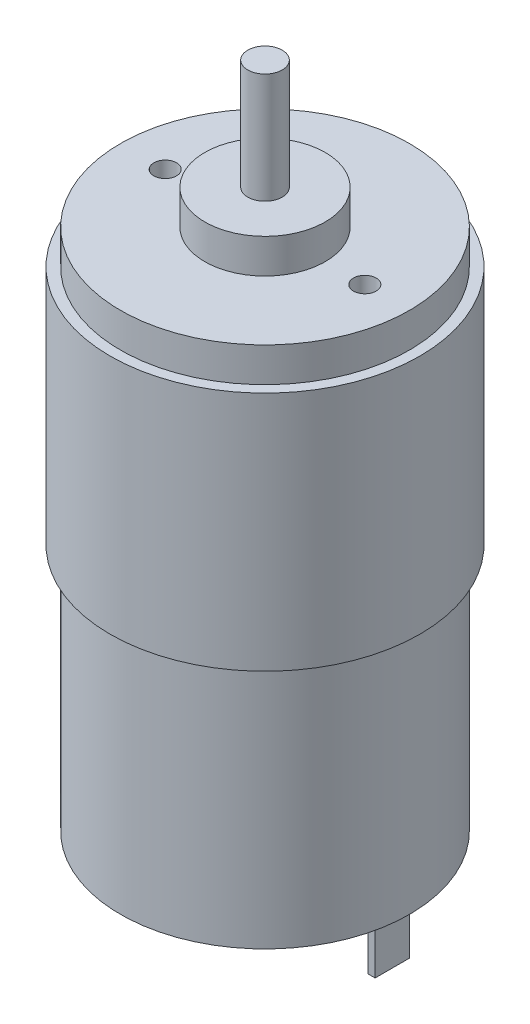
ISO-10303-21;
HEADER;
FILE_DESCRIPTION(('STEP AP214'),'2;1');
FILE_NAME('part.step','',(''),(''),'','','');
FILE_SCHEMA(('AUTOMOTIVE_DESIGN { 1 0 10303 214 1 1 1 1 }'));
ENDSEC;
DATA;
#1=APPLICATION_CONTEXT('core data for automotive mechanical design processes');
#2=APPLICATION_PROTOCOL_DEFINITION('international standard','automotive_design',2000,#1);
#3=PRODUCT_CONTEXT('',#1,'mechanical');
#4=PRODUCT('Part','Part','',(#3));
#5=PRODUCT_RELATED_PRODUCT_CATEGORY('part','',(#4));
#6=PRODUCT_DEFINITION_FORMATION('','',#4);
#7=PRODUCT_DEFINITION_CONTEXT('part definition',#1,'design');
#8=PRODUCT_DEFINITION('design','',#6,#7);
#9=PRODUCT_DEFINITION_SHAPE('','',#8);
#10=(LENGTH_UNIT() NAMED_UNIT(*) SI_UNIT(.MILLI.,.METRE.));
#11=(NAMED_UNIT(*) PLANE_ANGLE_UNIT() SI_UNIT($,.RADIAN.));
#12=(NAMED_UNIT(*) SI_UNIT($,.STERADIAN.) SOLID_ANGLE_UNIT());
#13=UNCERTAINTY_MEASURE_WITH_UNIT(LENGTH_MEASURE(1.E-05),#10,'distance_accuracy_value','');
#14=(GEOMETRIC_REPRESENTATION_CONTEXT(3) GLOBAL_UNCERTAINTY_ASSIGNED_CONTEXT((#13)) GLOBAL_UNIT_ASSIGNED_CONTEXT((#10,
#11,#12)) REPRESENTATION_CONTEXT('',''));
#15=CARTESIAN_POINT('',(0.,0.,0.));
#16=DIRECTION('',(0.,0.,1.));
#17=DIRECTION('',(1.,0.,0.));
#18=AXIS2_PLACEMENT_3D('',#15,#16,#17);
#19=CARTESIAN_POINT('',(21.,7.99999999999999,0.));
#20=DIRECTION('',(0.,-1.,0.));
#21=DIRECTION('',(0.,0.,-1.));
#22=AXIS2_PLACEMENT_3D('',#19,#20,#21);
#23=PLANE('',#22);
#24=CARTESIAN_POINT('',(0.,7.99999999999999,0.));
#25=DIRECTION('',(0.,-1.,0.));
#26=DIRECTION('',(0.,0.,-1.));
#27=AXIS2_PLACEMENT_3D('',#24,#25,#26);
#28=CIRCLE('',#27,21.);
#29=CARTESIAN_POINT('',(0.,7.99999999999999,-21.));
#30=VERTEX_POINT('',#29);
#31=EDGE_CURVE('E226',#30,#30,#28,.T.);
#32=ORIENTED_EDGE('',*,*,#31,.T.);
#33=EDGE_LOOP('',(#32));
#34=FACE_BOUND('',#33,.T.);
#35=CARTESIAN_POINT('',(0.,7.99999999999999,0.));
#36=DIRECTION('',(0.,-1.,0.));
#37=DIRECTION('',(0.,0.,-1.));
#38=AXIS2_PLACEMENT_3D('',#35,#36,#37);
#39=CIRCLE('',#38,8.75000000000001);
#40=CARTESIAN_POINT('',(0.,7.99999999999999,-8.75000000000001));
#41=VERTEX_POINT('',#40);
#42=EDGE_CURVE('E222',#41,#41,#39,.T.);
#43=ORIENTED_EDGE('',*,*,#42,.F.);
#44=EDGE_LOOP('',(#43));
#45=FACE_BOUND('',#44,.T.);
#46=DIRECTION('',(-1.,0.,0.));
#47=VECTOR('',#46,1.);
#48=CARTESIAN_POINT('',(18.5,7.99999999999999,2.5));
#49=LINE('',#48,#47);
#50=CARTESIAN_POINT('',(18.5,7.99999999999999,2.5));
#51=VERTEX_POINT('',#50);
#52=CARTESIAN_POINT('',(17.5,7.99999999999999,2.5));
#53=VERTEX_POINT('',#52);
#54=EDGE_CURVE('E168',#51,#53,#49,.T.);
#55=ORIENTED_EDGE('',*,*,#54,.F.);
#56=DIRECTION('',(0.,0.,1.));
#57=VECTOR('',#56,1.);
#58=CARTESIAN_POINT('',(18.5,7.99999999999999,-2.5));
#59=LINE('',#58,#57);
#60=CARTESIAN_POINT('',(18.5,7.99999999999999,-2.5));
#61=VERTEX_POINT('',#60);
#62=EDGE_CURVE('E160',#61,#51,#59,.T.);
#63=ORIENTED_EDGE('',*,*,#62,.F.);
#64=DIRECTION('',(1.,0.,0.));
#65=VECTOR('',#64,1.);
#66=CARTESIAN_POINT('',(18.5,7.99999999999999,-2.5));
#67=LINE('',#66,#65);
#68=CARTESIAN_POINT('',(17.5,7.99999999999999,-2.5));
#69=VERTEX_POINT('',#68);
#70=EDGE_CURVE('E164',#69,#61,#67,.T.);
#71=ORIENTED_EDGE('',*,*,#70,.F.);
#72=DIRECTION('',(0.,0.,-1.));
#73=VECTOR('',#72,1.);
#74=CARTESIAN_POINT('',(17.5,7.99999999999999,-2.5));
#75=LINE('',#74,#73);
#76=EDGE_CURVE('E69',#53,#69,#75,.T.);
#77=ORIENTED_EDGE('',*,*,#76,.F.);
#78=EDGE_LOOP('',(#55,#63,#71,#77));
#79=FACE_BOUND('',#78,.T.);
#80=DIRECTION('',(-1.,0.,0.));
#81=VECTOR('',#80,1.);
#82=CARTESIAN_POINT('',(-18.5,7.99999999999999,2.5));
#83=LINE('',#82,#81);
#84=CARTESIAN_POINT('',(-17.5,7.99999999999999,2.5));
#85=VERTEX_POINT('',#84);
#86=CARTESIAN_POINT('',(-18.5,7.99999999999999,2.5));
#87=VERTEX_POINT('',#86);
#88=EDGE_CURVE('E151',#85,#87,#83,.T.);
#89=ORIENTED_EDGE('',*,*,#88,.F.);
#90=DIRECTION('',(0.,0.,1.));
#91=VECTOR('',#90,1.);
#92=CARTESIAN_POINT('',(-17.5,7.99999999999999,-2.5));
#93=LINE('',#92,#91);
#94=CARTESIAN_POINT('',(-17.5,7.99999999999999,-2.5));
#95=VERTEX_POINT('',#94);
#96=EDGE_CURVE('E143',#95,#85,#93,.T.);
#97=ORIENTED_EDGE('',*,*,#96,.F.);
#98=DIRECTION('',(1.,0.,0.));
#99=VECTOR('',#98,1.);
#100=CARTESIAN_POINT('',(-18.5,7.99999999999999,-2.5));
#101=LINE('',#100,#99);
#102=CARTESIAN_POINT('',(-18.5,7.99999999999999,-2.5));
#103=VERTEX_POINT('',#102);
#104=EDGE_CURVE('E118',#103,#95,#101,.T.);
#105=ORIENTED_EDGE('',*,*,#104,.F.);
#106=DIRECTION('',(0.,0.,-1.));
#107=VECTOR('',#106,1.);
#108=CARTESIAN_POINT('',(-18.5,7.99999999999999,-2.5));
#109=LINE('',#108,#107);
#110=EDGE_CURVE('E61',#87,#103,#109,.T.);
#111=ORIENTED_EDGE('',*,*,#110,.F.);
#112=EDGE_LOOP('',(#89,#97,#105,#111));
#113=FACE_BOUND('',#112,.T.);
#114=ADVANCED_FACE('F45',(#34,#45,#79,#113),#23,.T.);
#115=CARTESIAN_POINT('',(2.5,0.,0.));
#116=DIRECTION('',(0.,-1.,0.));
#117=DIRECTION('',(0.,0.,-1.));
#118=AXIS2_PLACEMENT_3D('',#115,#116,#117);
#119=PLANE('',#118);
#120=CARTESIAN_POINT('',(0.,0.,0.));
#121=DIRECTION('',(0.,-1.,0.));
#122=DIRECTION('',(0.,0.,-1.));
#123=AXIS2_PLACEMENT_3D('',#120,#121,#122);
#124=CIRCLE('',#123,2.5);
#125=CARTESIAN_POINT('',(0.,0.,-2.5));
#126=VERTEX_POINT('',#125);
#127=EDGE_CURVE('E203',#126,#126,#124,.T.);
#128=ORIENTED_EDGE('',*,*,#127,.T.);
#129=EDGE_LOOP('',(#128));
#130=FACE_BOUND('',#129,.T.);
#131=ADVANCED_FACE('F47',(#130),#119,.T.);
#132=CARTESIAN_POINT('',(0.,105.,0.));
#133=DIRECTION('',(0.,1.,0.));
#134=DIRECTION('',(0.,0.,1.));
#135=AXIS2_PLACEMENT_3D('',#132,#133,#134);
#136=PLANE('',#135);
#137=CARTESIAN_POINT('',(0.,105.,0.));
#138=DIRECTION('',(0.,-1.,0.));
#139=DIRECTION('',(0.,0.,-1.));
#140=AXIS2_PLACEMENT_3D('',#137,#138,#139);
#141=CIRCLE('',#140,2.5);
#142=CARTESIAN_POINT('',(0.,105.,-2.5));
#143=VERTEX_POINT('',#142);
#144=EDGE_CURVE('E11',#143,#143,#141,.T.);
#145=ORIENTED_EDGE('',*,*,#144,.F.);
#146=EDGE_LOOP('',(#145));
#147=FACE_BOUND('',#146,.T.);
#148=ADVANCED_FACE('F266',(#147),#136,.T.);
#149=CARTESIAN_POINT('',(0.,0.,0.));
#150=DIRECTION('',(0.,-1.,0.));
#151=DIRECTION('',(0.,0.,-1.));
#152=AXIS2_PLACEMENT_3D('',#149,#150,#151);
#153=CYLINDRICAL_SURFACE('',#152,2.5);
#154=ORIENTED_EDGE('',*,*,#144,.T.);
#155=EDGE_LOOP('',(#154));
#156=FACE_BOUND('',#155,.T.);
#157=CARTESIAN_POINT('',(0.,89.,0.));
#158=DIRECTION('',(0.,-1.,0.));
#159=DIRECTION('',(0.,0.,-1.));
#160=AXIS2_PLACEMENT_3D('',#157,#158,#159);
#161=CIRCLE('',#160,2.5);
#162=CARTESIAN_POINT('',(0.,89.,-2.5));
#163=VERTEX_POINT('',#162);
#164=EDGE_CURVE('E54',#163,#163,#161,.T.);
#165=ORIENTED_EDGE('',*,*,#164,.F.);
#166=EDGE_LOOP('',(#165));
#167=FACE_BOUND('',#166,.T.);
#168=ADVANCED_FACE('F264',(#156,#167),#153,.T.);
#169=CARTESIAN_POINT('',(2.5,89.,0.));
#170=DIRECTION('',(0.,1.,0.));
#171=DIRECTION('',(0.,0.,1.));
#172=AXIS2_PLACEMENT_3D('',#169,#170,#171);
#173=PLANE('',#172);
#174=ORIENTED_EDGE('',*,*,#164,.T.);
#175=EDGE_LOOP('',(#174));
#176=FACE_BOUND('',#175,.T.);
#177=CARTESIAN_POINT('',(0.,89.,0.));
#178=DIRECTION('',(0.,-1.,0.));
#179=DIRECTION('',(0.,0.,-1.));
#180=AXIS2_PLACEMENT_3D('',#177,#178,#179);
#181=CIRCLE('',#180,8.75);
#182=CARTESIAN_POINT('',(0.,89.,-8.75));
#183=VERTEX_POINT('',#182);
#184=EDGE_CURVE('E254',#183,#183,#181,.T.);
#185=ORIENTED_EDGE('',*,*,#184,.F.);
#186=EDGE_LOOP('',(#185));
#187=FACE_BOUND('',#186,.T.);
#188=ADVANCED_FACE('F261',(#176,#187),#173,.T.);
#189=CARTESIAN_POINT('',(0.,0.,0.));
#190=DIRECTION('',(0.,-1.,0.));
#191=DIRECTION('',(0.,0.,-1.));
#192=AXIS2_PLACEMENT_3D('',#189,#190,#191);
#193=CYLINDRICAL_SURFACE('',#192,8.75);
#194=ORIENTED_EDGE('',*,*,#184,.T.);
#195=EDGE_LOOP('',(#194));
#196=FACE_BOUND('',#195,.T.);
#197=CARTESIAN_POINT('',(0.,84.,0.));
#198=DIRECTION('',(0.,-1.,0.));
#199=DIRECTION('',(0.,0.,-1.));
#200=AXIS2_PLACEMENT_3D('',#197,#198,#199);
#201=CIRCLE('',#200,8.75);
#202=CARTESIAN_POINT('',(0.,84.,-8.75));
#203=VERTEX_POINT('',#202);
#204=EDGE_CURVE('E250',#203,#203,#201,.T.);
#205=ORIENTED_EDGE('',*,*,#204,.F.);
#206=EDGE_LOOP('',(#205));
#207=FACE_BOUND('',#206,.T.);
#208=ADVANCED_FACE('F273',(#196,#207),#193,.T.);
#209=CARTESIAN_POINT('',(8.75,84.,0.));
#210=DIRECTION('',(0.,1.,0.));
#211=DIRECTION('',(0.,0.,1.));
#212=AXIS2_PLACEMENT_3D('',#209,#210,#211);
#213=PLANE('',#212);
#214=CARTESIAN_POINT('',(14.5,84.,0.));
#215=DIRECTION('',(0.,1.,0.));
#216=DIRECTION('',(0.,0.,1.));
#217=AXIS2_PLACEMENT_3D('',#214,#215,#216);
#218=CIRCLE('',#217,1.65);
#219=CARTESIAN_POINT('',(14.5,84.,1.65));
#220=VERTEX_POINT('',#219);
#221=EDGE_CURVE('E204',#220,#220,#218,.T.);
#222=ORIENTED_EDGE('',*,*,#221,.F.);
#223=EDGE_LOOP('',(#222));
#224=FACE_BOUND('',#223,.T.);
#225=CARTESIAN_POINT('',(-14.5,84.,0.));
#226=DIRECTION('',(0.,1.,0.));
#227=DIRECTION('',(0.,0.,-1.));
#228=AXIS2_PLACEMENT_3D('',#225,#226,#227);
#229=CIRCLE('',#228,1.65);
#230=CARTESIAN_POINT('',(-14.5,84.,-1.65));
#231=VERTEX_POINT('',#230);
#232=EDGE_CURVE('E139',#231,#231,#229,.T.);
#233=ORIENTED_EDGE('',*,*,#232,.F.);
#234=EDGE_LOOP('',(#233));
#235=FACE_BOUND('',#234,.T.);
#236=ORIENTED_EDGE('',*,*,#204,.T.);
#237=EDGE_LOOP('',(#236));
#238=FACE_BOUND('',#237,.T.);
#239=CARTESIAN_POINT('',(0.,84.,0.));
#240=DIRECTION('',(0.,-1.,0.));
#241=DIRECTION('',(0.,0.,-1.));
#242=AXIS2_PLACEMENT_3D('',#239,#240,#241);
#243=CIRCLE('',#242,21.);
#244=CARTESIAN_POINT('',(0.,84.,-21.));
#245=VERTEX_POINT('',#244);
#246=EDGE_CURVE('E246',#245,#245,#243,.T.);
#247=ORIENTED_EDGE('',*,*,#246,.F.);
#248=EDGE_LOOP('',(#247));
#249=FACE_BOUND('',#248,.T.);
#250=ADVANCED_FACE('F309',(#224,#235,#238,#249),#213,.T.);
#251=CARTESIAN_POINT('',(0.,0.,0.));
#252=DIRECTION('',(0.,-1.,0.));
#253=DIRECTION('',(0.,0.,-1.));
#254=AXIS2_PLACEMENT_3D('',#251,#252,#253);
#255=CYLINDRICAL_SURFACE('',#254,21.);
#256=ORIENTED_EDGE('',*,*,#246,.T.);
#257=EDGE_LOOP('',(#256));
#258=FACE_BOUND('',#257,.T.);
#259=CARTESIAN_POINT('',(0.,79.,0.));
#260=DIRECTION('',(0.,-1.,0.));
#261=DIRECTION('',(0.,0.,-1.));
#262=AXIS2_PLACEMENT_3D('',#259,#260,#261);
#263=CIRCLE('',#262,21.);
#264=CARTESIAN_POINT('',(0.,79.,-21.));
#265=VERTEX_POINT('',#264);
#266=EDGE_CURVE('E242',#265,#265,#263,.T.);
#267=ORIENTED_EDGE('',*,*,#266,.F.);
#268=EDGE_LOOP('',(#267));
#269=FACE_BOUND('',#268,.T.);
#270=ADVANCED_FACE('F305',(#258,#269),#255,.T.);
#271=CARTESIAN_POINT('',(21.,79.,0.));
#272=DIRECTION('',(0.,1.,0.));
#273=DIRECTION('',(0.,0.,1.));
#274=AXIS2_PLACEMENT_3D('',#271,#272,#273);
#275=PLANE('',#274);
#276=ORIENTED_EDGE('',*,*,#266,.T.);
#277=EDGE_LOOP('',(#276));
#278=FACE_BOUND('',#277,.T.);
#279=CARTESIAN_POINT('',(0.,79.,0.));
#280=DIRECTION('',(0.,-1.,0.));
#281=DIRECTION('',(0.,0.,-1.));
#282=AXIS2_PLACEMENT_3D('',#279,#280,#281);
#283=CIRCLE('',#282,22.5);
#284=CARTESIAN_POINT('',(0.,79.,-22.5));
#285=VERTEX_POINT('',#284);
#286=EDGE_CURVE('E238',#285,#285,#283,.T.);
#287=ORIENTED_EDGE('',*,*,#286,.F.);
#288=EDGE_LOOP('',(#287));
#289=FACE_BOUND('',#288,.T.);
#290=ADVANCED_FACE('F301',(#278,#289),#275,.T.);
#291=CARTESIAN_POINT('',(0.,0.,0.));
#292=DIRECTION('',(0.,-1.,0.));
#293=DIRECTION('',(0.,0.,-1.));
#294=AXIS2_PLACEMENT_3D('',#291,#292,#293);
#295=CYLINDRICAL_SURFACE('',#294,22.5);
#296=ORIENTED_EDGE('',*,*,#286,.T.);
#297=EDGE_LOOP('',(#296));
#298=FACE_BOUND('',#297,.T.);
#299=CARTESIAN_POINT('',(0.,44.,0.));
#300=DIRECTION('',(0.,-1.,0.));
#301=DIRECTION('',(0.,0.,-1.));
#302=AXIS2_PLACEMENT_3D('',#299,#300,#301);
#303=CIRCLE('',#302,22.5);
#304=CARTESIAN_POINT('',(0.,44.,-22.5));
#305=VERTEX_POINT('',#304);
#306=EDGE_CURVE('E234',#305,#305,#303,.T.);
#307=ORIENTED_EDGE('',*,*,#306,.F.);
#308=EDGE_LOOP('',(#307));
#309=FACE_BOUND('',#308,.T.);
#310=ADVANCED_FACE('F297',(#298,#309),#295,.T.);
#311=CARTESIAN_POINT('',(22.5,44.,0.));
#312=DIRECTION('',(0.,-1.,0.));
#313=DIRECTION('',(0.,0.,-1.));
#314=AXIS2_PLACEMENT_3D('',#311,#312,#313);
#315=PLANE('',#314);
#316=ORIENTED_EDGE('',*,*,#306,.T.);
#317=EDGE_LOOP('',(#316));
#318=FACE_BOUND('',#317,.T.);
#319=CARTESIAN_POINT('',(0.,44.,0.));
#320=DIRECTION('',(0.,-1.,0.));
#321=DIRECTION('',(0.,0.,-1.));
#322=AXIS2_PLACEMENT_3D('',#319,#320,#321);
#323=CIRCLE('',#322,21.);
#324=CARTESIAN_POINT('',(0.,44.,-21.));
#325=VERTEX_POINT('',#324);
#326=EDGE_CURVE('E230',#325,#325,#323,.T.);
#327=ORIENTED_EDGE('',*,*,#326,.F.);
#328=EDGE_LOOP('',(#327));
#329=FACE_BOUND('',#328,.T.);
#330=ADVANCED_FACE('F293',(#318,#329),#315,.T.);
#331=CARTESIAN_POINT('',(0.,0.,0.));
#332=DIRECTION('',(0.,-1.,0.));
#333=DIRECTION('',(0.,0.,-1.));
#334=AXIS2_PLACEMENT_3D('',#331,#332,#333);
#335=CYLINDRICAL_SURFACE('',#334,21.);
#336=ORIENTED_EDGE('',*,*,#326,.T.);
#337=EDGE_LOOP('',(#336));
#338=FACE_BOUND('',#337,.T.);
#339=ORIENTED_EDGE('',*,*,#31,.F.);
#340=EDGE_LOOP('',(#339));
#341=FACE_BOUND('',#340,.T.);
#342=ADVANCED_FACE('F290',(#338,#341),#335,.T.);
#343=CARTESIAN_POINT('',(0.,0.,0.));
#344=DIRECTION('',(0.,-1.,0.));
#345=DIRECTION('',(0.,0.,-1.));
#346=AXIS2_PLACEMENT_3D('',#343,#344,#345);
#347=CYLINDRICAL_SURFACE('',#346,8.75000000000001);
#348=ORIENTED_EDGE('',*,*,#42,.T.);
#349=EDGE_LOOP('',(#348));
#350=FACE_BOUND('',#349,.T.);
#351=CARTESIAN_POINT('',(0.,2.99999999999999,0.));
#352=DIRECTION('',(0.,-1.,0.));
#353=DIRECTION('',(0.,0.,-1.));
#354=AXIS2_PLACEMENT_3D('',#351,#352,#353);
#355=CIRCLE('',#354,8.75000000000001);
#356=CARTESIAN_POINT('',(0.,2.99999999999999,-8.75000000000001));
#357=VERTEX_POINT('',#356);
#358=EDGE_CURVE('E218',#357,#357,#355,.T.);
#359=ORIENTED_EDGE('',*,*,#358,.F.);
#360=EDGE_LOOP('',(#359));
#361=FACE_BOUND('',#360,.T.);
#362=ADVANCED_FACE('F288',(#350,#361),#347,.T.);
#363=CARTESIAN_POINT('',(8.75000000000001,2.99999999999999,0.));
#364=DIRECTION('',(0.,-1.,0.));
#365=DIRECTION('',(0.,0.,-1.));
#366=AXIS2_PLACEMENT_3D('',#363,#364,#365);
#367=PLANE('',#366);
#368=ORIENTED_EDGE('',*,*,#358,.T.);
#369=EDGE_LOOP('',(#368));
#370=FACE_BOUND('',#369,.T.);
#371=CARTESIAN_POINT('',(0.,2.99999999999999,0.));
#372=DIRECTION('',(0.,-1.,0.));
#373=DIRECTION('',(0.,0.,-1.));
#374=AXIS2_PLACEMENT_3D('',#371,#372,#373);
#375=CIRCLE('',#374,2.50000000000001);
#376=CARTESIAN_POINT('',(0.,2.99999999999999,-2.50000000000001));
#377=VERTEX_POINT('',#376);
#378=EDGE_CURVE('E214',#377,#377,#375,.T.);
#379=ORIENTED_EDGE('',*,*,#378,.F.);
#380=EDGE_LOOP('',(#379));
#381=FACE_BOUND('',#380,.T.);
#382=ADVANCED_FACE('F369',(#370,#381),#367,.T.);
#383=CARTESIAN_POINT('',(0.,0.,0.));
#384=DIRECTION('',(0.,-1.,0.));
#385=DIRECTION('',(0.,0.,-1.));
#386=AXIS2_PLACEMENT_3D('',#383,#384,#385);
#387=CYLINDRICAL_SURFACE('',#386,2.50000000000001);
#388=ORIENTED_EDGE('',*,*,#378,.T.);
#389=EDGE_LOOP('',(#388));
#390=FACE_BOUND('',#389,.T.);
#391=ORIENTED_EDGE('',*,*,#127,.F.);
#392=EDGE_LOOP('',(#391));
#393=FACE_BOUND('',#392,.T.);
#394=ADVANCED_FACE('F377',(#390,#393),#387,.T.);
#395=CARTESIAN_POINT('',(-14.5,64.,0.));
#396=DIRECTION('',(0.,1.,0.));
#397=DIRECTION('',(0.,0.,1.));
#398=AXIS2_PLACEMENT_3D('',#395,#396,#397);
#399=CYLINDRICAL_SURFACE('',#398,1.65);
#400=CARTESIAN_POINT('',(-14.5,64.,0.));
#401=DIRECTION('',(0.,1.,0.));
#402=DIRECTION('',(0.,0.,-1.));
#403=AXIS2_PLACEMENT_3D('',#400,#401,#402);
#404=CIRCLE('',#403,1.65);
#405=CARTESIAN_POINT('',(-14.5,64.,-1.65));
#406=VERTEX_POINT('',#405);
#407=EDGE_CURVE('E134',#406,#406,#404,.T.);
#408=ORIENTED_EDGE('',*,*,#407,.F.);
#409=EDGE_LOOP('',(#408));
#410=FACE_BOUND('',#409,.T.);
#411=ORIENTED_EDGE('',*,*,#232,.T.);
#412=EDGE_LOOP('',(#411));
#413=FACE_BOUND('',#412,.T.);
#414=ADVANCED_FACE('F384',(#410,#413),#399,.F.);
#415=CARTESIAN_POINT('',(-14.5,64.,0.));
#416=DIRECTION('',(0.,-1.,0.));
#417=DIRECTION('',(0.,0.,-1.));
#418=AXIS2_PLACEMENT_3D('',#415,#416,#417);
#419=PLANE('',#418);
#420=ORIENTED_EDGE('',*,*,#407,.T.);
#421=EDGE_LOOP('',(#420));
#422=FACE_BOUND('',#421,.T.);
#423=ADVANCED_FACE('F398',(#422),#419,.F.);
#424=CARTESIAN_POINT('',(14.5,64.,0.));
#425=DIRECTION('',(0.,1.,0.));
#426=DIRECTION('',(0.,0.,1.));
#427=AXIS2_PLACEMENT_3D('',#424,#425,#426);
#428=CYLINDRICAL_SURFACE('',#427,1.65);
#429=CARTESIAN_POINT('',(14.5,64.,0.));
#430=DIRECTION('',(0.,1.,0.));
#431=DIRECTION('',(0.,0.,1.));
#432=AXIS2_PLACEMENT_3D('',#429,#430,#431);
#433=CIRCLE('',#432,1.65);
#434=CARTESIAN_POINT('',(14.5,64.,1.65));
#435=VERTEX_POINT('',#434);
#436=EDGE_CURVE('E199',#435,#435,#433,.T.);
#437=ORIENTED_EDGE('',*,*,#436,.F.);
#438=EDGE_LOOP('',(#437));
#439=FACE_BOUND('',#438,.T.);
#440=ORIENTED_EDGE('',*,*,#221,.T.);
#441=EDGE_LOOP('',(#440));
#442=FACE_BOUND('',#441,.T.);
#443=ADVANCED_FACE('F407',(#439,#442),#428,.F.);
#444=CARTESIAN_POINT('',(14.5,64.,0.));
#445=DIRECTION('',(0.,1.,0.));
#446=DIRECTION('',(0.,0.,1.));
#447=AXIS2_PLACEMENT_3D('',#444,#445,#446);
#448=PLANE('',#447);
#449=ORIENTED_EDGE('',*,*,#436,.T.);
#450=EDGE_LOOP('',(#449));
#451=FACE_BOUND('',#450,.T.);
#452=ADVANCED_FACE('F415',(#451),#448,.T.);
#453=CARTESIAN_POINT('',(18.5,-5.09901951359279,-2.5));
#454=DIRECTION('',(-1.,0.,0.));
#455=DIRECTION('',(0.,0.,1.));
#456=AXIS2_PLACEMENT_3D('',#453,#454,#455);
#457=PLANE('',#456);
#458=DIRECTION('',(0.,0.,1.));
#459=VECTOR('',#458,1.);
#460=CARTESIAN_POINT('',(18.5,0.,-2.5));
#461=LINE('',#460,#459);
#462=CARTESIAN_POINT('',(18.5,0.,-2.5));
#463=VERTEX_POINT('',#462);
#464=CARTESIAN_POINT('',(18.5,0.,2.5));
#465=VERTEX_POINT('',#464);
#466=EDGE_CURVE('E176',#463,#465,#461,.T.);
#467=ORIENTED_EDGE('',*,*,#466,.F.);
#468=DIRECTION('',(0.,1.,0.));
#469=VECTOR('',#468,1.);
#470=CARTESIAN_POINT('',(18.5,-5.09901951359279,-2.5));
#471=LINE('',#470,#469);
#472=EDGE_CURVE('E157',#463,#61,#471,.T.);
#473=ORIENTED_EDGE('',*,*,#472,.T.);
#474=ORIENTED_EDGE('',*,*,#62,.T.);
#475=DIRECTION('',(0.,1.,0.));
#476=VECTOR('',#475,1.);
#477=CARTESIAN_POINT('',(18.5,-5.09901951359279,2.5));
#478=LINE('',#477,#476);
#479=EDGE_CURVE('E169',#465,#51,#478,.T.);
#480=ORIENTED_EDGE('',*,*,#479,.F.);
#481=EDGE_LOOP('',(#467,#473,#474,#480));
#482=FACE_BOUND('',#481,.T.);
#483=ADVANCED_FACE('F423',(#482),#457,.F.);
#484=CARTESIAN_POINT('',(18.5,-5.09901951359279,2.5));
#485=DIRECTION('',(0.,0.,-1.));
#486=DIRECTION('',(-1.,0.,0.));
#487=AXIS2_PLACEMENT_3D('',#484,#485,#486);
#488=PLANE('',#487);
#489=DIRECTION('',(-1.,0.,0.));
#490=VECTOR('',#489,1.);
#491=CARTESIAN_POINT('',(18.5,0.,2.5));
#492=LINE('',#491,#490);
#493=CARTESIAN_POINT('',(17.5,0.,2.5));
#494=VERTEX_POINT('',#493);
#495=EDGE_CURVE('E180',#465,#494,#492,.T.);
#496=ORIENTED_EDGE('',*,*,#495,.F.);
#497=ORIENTED_EDGE('',*,*,#479,.T.);
#498=ORIENTED_EDGE('',*,*,#54,.T.);
#499=DIRECTION('',(0.,1.,0.));
#500=VECTOR('',#499,1.);
#501=CARTESIAN_POINT('',(17.5,-5.09901951359279,2.5));
#502=LINE('',#501,#500);
#503=EDGE_CURVE('E165',#494,#53,#502,.T.);
#504=ORIENTED_EDGE('',*,*,#503,.F.);
#505=EDGE_LOOP('',(#496,#497,#498,#504));
#506=FACE_BOUND('',#505,.T.);
#507=ADVANCED_FACE('F439',(#506),#488,.F.);
#508=CARTESIAN_POINT('',(17.5,-5.09901951359279,-2.5));
#509=DIRECTION('',(1.,0.,0.));
#510=DIRECTION('',(0.,0.,-1.));
#511=AXIS2_PLACEMENT_3D('',#508,#509,#510);
#512=PLANE('',#511);
#513=DIRECTION('',(0.,0.,-1.));
#514=VECTOR('',#513,1.);
#515=CARTESIAN_POINT('',(17.5,0.,-2.5));
#516=LINE('',#515,#514);
#517=CARTESIAN_POINT('',(17.5,0.,-2.5));
#518=VERTEX_POINT('',#517);
#519=EDGE_CURVE('E184',#494,#518,#516,.T.);
#520=ORIENTED_EDGE('',*,*,#519,.F.);
#521=ORIENTED_EDGE('',*,*,#503,.T.);
#522=ORIENTED_EDGE('',*,*,#76,.T.);
#523=DIRECTION('',(0.,1.,0.));
#524=VECTOR('',#523,1.);
#525=CARTESIAN_POINT('',(17.5,-5.09901951359279,-2.5));
#526=LINE('',#525,#524);
#527=EDGE_CURVE('E161',#518,#69,#526,.T.);
#528=ORIENTED_EDGE('',*,*,#527,.F.);
#529=EDGE_LOOP('',(#520,#521,#522,#528));
#530=FACE_BOUND('',#529,.T.);
#531=ADVANCED_FACE('F449',(#530),#512,.F.);
#532=CARTESIAN_POINT('',(18.5,-5.09901951359279,-2.5));
#533=DIRECTION('',(0.,0.,1.));
#534=DIRECTION('',(1.,0.,0.));
#535=AXIS2_PLACEMENT_3D('',#532,#533,#534);
#536=PLANE('',#535);
#537=DIRECTION('',(1.,0.,0.));
#538=VECTOR('',#537,1.);
#539=CARTESIAN_POINT('',(18.5,0.,-2.5));
#540=LINE('',#539,#538);
#541=EDGE_CURVE('E172',#518,#463,#540,.T.);
#542=ORIENTED_EDGE('',*,*,#541,.F.);
#543=ORIENTED_EDGE('',*,*,#527,.T.);
#544=ORIENTED_EDGE('',*,*,#70,.T.);
#545=ORIENTED_EDGE('',*,*,#472,.F.);
#546=EDGE_LOOP('',(#542,#543,#544,#545));
#547=FACE_BOUND('',#546,.T.);
#548=ADVANCED_FACE('F459',(#547),#536,.F.);
#549=CARTESIAN_POINT('',(2.5,0.,0.));
#550=DIRECTION('',(0.,-1.,0.));
#551=DIRECTION('',(0.,0.,-1.));
#552=AXIS2_PLACEMENT_3D('',#549,#550,#551);
#553=PLANE('',#552);
#554=ORIENTED_EDGE('',*,*,#541,.T.);
#555=ORIENTED_EDGE('',*,*,#466,.T.);
#556=ORIENTED_EDGE('',*,*,#495,.T.);
#557=ORIENTED_EDGE('',*,*,#519,.T.);
#558=EDGE_LOOP('',(#554,#555,#556,#557));
#559=FACE_BOUND('',#558,.T.);
#560=ADVANCED_FACE('F468',(#559),#553,.T.);
#561=CARTESIAN_POINT('',(-17.5,-5.09901951359279,-2.5));
#562=DIRECTION('',(-1.,0.,0.));
#563=DIRECTION('',(0.,0.,1.));
#564=AXIS2_PLACEMENT_3D('',#561,#562,#563);
#565=PLANE('',#564);
#566=DIRECTION('',(0.,0.,1.));
#567=VECTOR('',#566,1.);
#568=CARTESIAN_POINT('',(-17.5,0.,-2.5));
#569=LINE('',#568,#567);
#570=CARTESIAN_POINT('',(-17.5,0.,-2.5));
#571=VERTEX_POINT('',#570);
#572=CARTESIAN_POINT('',(-17.5,0.,2.5));
#573=VERTEX_POINT('',#572);
#574=EDGE_CURVE('E128',#571,#573,#569,.T.);
#575=ORIENTED_EDGE('',*,*,#574,.F.);
#576=DIRECTION('',(0.,1.,0.));
#577=VECTOR('',#576,1.);
#578=CARTESIAN_POINT('',(-17.5,-5.09901951359279,-2.5));
#579=LINE('',#578,#577);
#580=EDGE_CURVE('E123',#571,#95,#579,.T.);
#581=ORIENTED_EDGE('',*,*,#580,.T.);
#582=ORIENTED_EDGE('',*,*,#96,.T.);
#583=DIRECTION('',(0.,1.,0.));
#584=VECTOR('',#583,1.);
#585=CARTESIAN_POINT('',(-17.5,-5.09901951359279,2.5));
#586=LINE('',#585,#584);
#587=EDGE_CURVE('E148',#573,#85,#586,.T.);
#588=ORIENTED_EDGE('',*,*,#587,.F.);
#589=EDGE_LOOP('',(#575,#581,#582,#588));
#590=FACE_BOUND('',#589,.T.);
#591=ADVANCED_FACE('F478',(#590),#565,.F.);
#592=CARTESIAN_POINT('',(-18.5,-5.09901951359279,2.5));
#593=DIRECTION('',(0.,0.,-1.));
#594=DIRECTION('',(-1.,0.,0.));
#595=AXIS2_PLACEMENT_3D('',#592,#593,#594);
#596=PLANE('',#595);
#597=DIRECTION('',(-1.,0.,0.));
#598=VECTOR('',#597,1.);
#599=CARTESIAN_POINT('',(-18.5,0.,2.5));
#600=LINE('',#599,#598);
#601=CARTESIAN_POINT('',(-18.5,0.,2.5));
#602=VERTEX_POINT('',#601);
#603=EDGE_CURVE('E132',#573,#602,#600,.T.);
#604=ORIENTED_EDGE('',*,*,#603,.F.);
#605=ORIENTED_EDGE('',*,*,#587,.T.);
#606=ORIENTED_EDGE('',*,*,#88,.T.);
#607=DIRECTION('',(0.,1.,0.));
#608=VECTOR('',#607,1.);
#609=CARTESIAN_POINT('',(-18.5,-5.09901951359279,2.5));
#610=LINE('',#609,#608);
#611=EDGE_CURVE('E152',#602,#87,#610,.T.);
#612=ORIENTED_EDGE('',*,*,#611,.F.);
#613=EDGE_LOOP('',(#604,#605,#606,#612));
#614=FACE_BOUND('',#613,.T.);
#615=ADVANCED_FACE('F488',(#614),#596,.F.);
#616=CARTESIAN_POINT('',(-18.5,-5.09901951359279,-2.5));
#617=DIRECTION('',(1.,0.,0.));
#618=DIRECTION('',(0.,0.,-1.));
#619=AXIS2_PLACEMENT_3D('',#616,#617,#618);
#620=PLANE('',#619);
#621=DIRECTION('',(0.,0.,-1.));
#622=VECTOR('',#621,1.);
#623=CARTESIAN_POINT('',(-18.5,0.,-2.5));
#624=LINE('',#623,#622);
#625=CARTESIAN_POINT('',(-18.5,0.,-2.5));
#626=VERTEX_POINT('',#625);
#627=EDGE_CURVE('E112',#602,#626,#624,.T.);
#628=ORIENTED_EDGE('',*,*,#627,.F.);
#629=ORIENTED_EDGE('',*,*,#611,.T.);
#630=ORIENTED_EDGE('',*,*,#110,.T.);
#631=DIRECTION('',(0.,1.,0.));
#632=VECTOR('',#631,1.);
#633=CARTESIAN_POINT('',(-18.5,-5.09901951359279,-2.5));
#634=LINE('',#633,#632);
#635=EDGE_CURVE('E108',#626,#103,#634,.T.);
#636=ORIENTED_EDGE('',*,*,#635,.F.);
#637=EDGE_LOOP('',(#628,#629,#630,#636));
#638=FACE_BOUND('',#637,.T.);
#639=ADVANCED_FACE('F110',(#638),#620,.F.);
#640=CARTESIAN_POINT('',(-18.5,-5.09901951359279,-2.5));
#641=DIRECTION('',(0.,0.,1.));
#642=DIRECTION('',(1.,0.,0.));
#643=AXIS2_PLACEMENT_3D('',#640,#641,#642);
#644=PLANE('',#643);
#645=DIRECTION('',(1.,0.,0.));
#646=VECTOR('',#645,1.);
#647=CARTESIAN_POINT('',(-18.5,0.,-2.5));
#648=LINE('',#647,#646);
#649=EDGE_CURVE('E121',#626,#571,#648,.T.);
#650=ORIENTED_EDGE('',*,*,#649,.F.);
#651=ORIENTED_EDGE('',*,*,#635,.T.);
#652=ORIENTED_EDGE('',*,*,#104,.T.);
#653=ORIENTED_EDGE('',*,*,#580,.F.);
#654=EDGE_LOOP('',(#650,#651,#652,#653));
#655=FACE_BOUND('',#654,.T.);
#656=ADVANCED_FACE('F122',(#655),#644,.F.);
#657=CARTESIAN_POINT('',(2.5,0.,0.));
#658=DIRECTION('',(0.,-1.,0.));
#659=DIRECTION('',(0.,0.,-1.));
#660=AXIS2_PLACEMENT_3D('',#657,#658,#659);
#661=PLANE('',#660);
#662=ORIENTED_EDGE('',*,*,#649,.T.);
#663=ORIENTED_EDGE('',*,*,#574,.T.);
#664=ORIENTED_EDGE('',*,*,#603,.T.);
#665=ORIENTED_EDGE('',*,*,#627,.T.);
#666=EDGE_LOOP('',(#662,#663,#664,#665));
#667=FACE_BOUND('',#666,.T.);
#668=ADVANCED_FACE('F131',(#667),#661,.T.);
#669=CLOSED_SHELL('',(#114,#131,#148,#168,#188,#208,#250,#270,#290,#310,#330,#342,#362,#382,
#394,#414,#423,#443,#452,#483,#507,#531,#548,#560,#591,#615,#639,#656,#668));
#670=MANIFOLD_SOLID_BREP('B2',#669);
#671=ADVANCED_BREP_SHAPE_REPRESENTATION('',(#18,#670),#14);
#672=SHAPE_DEFINITION_REPRESENTATION(#9,#671);
ENDSEC;
END-ISO-10303-21;
